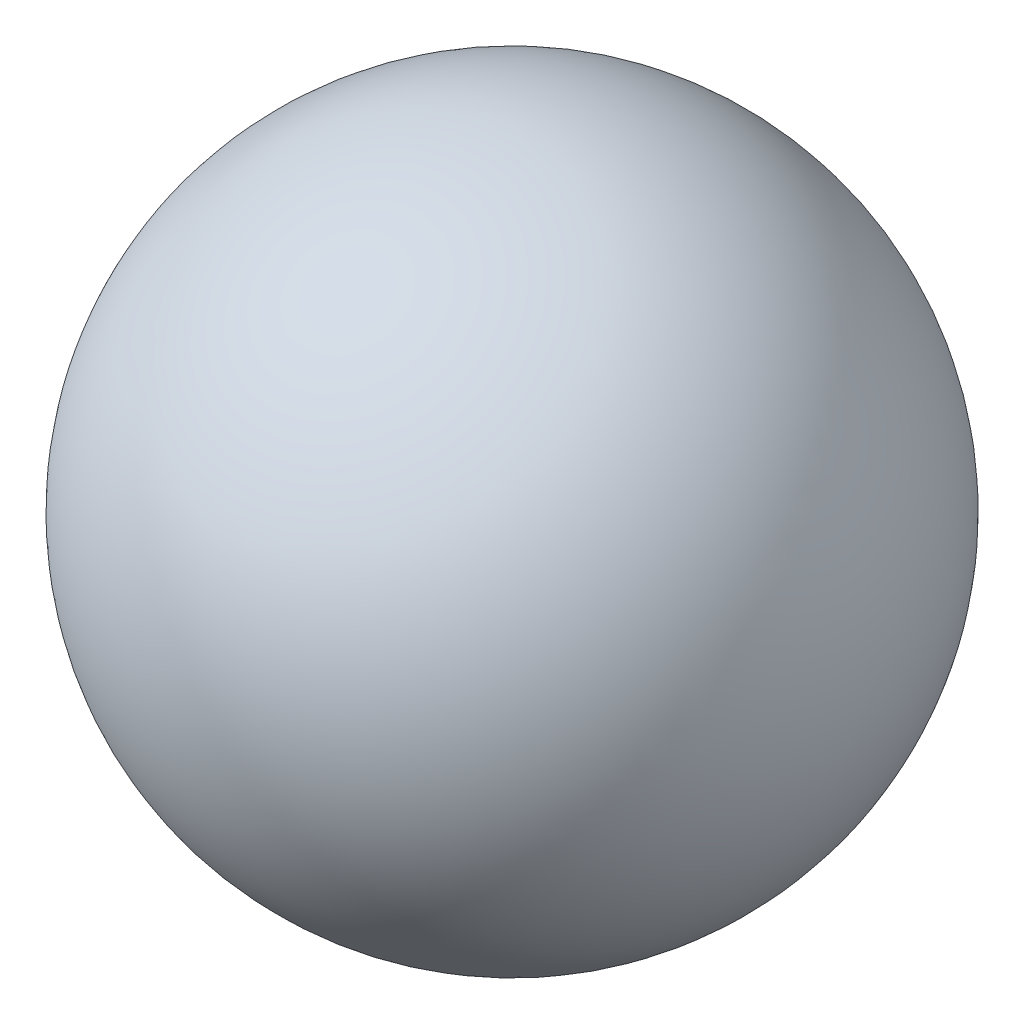
ISO-10303-21;
HEADER;
FILE_DESCRIPTION(('STEP AP214'),'2;1');
FILE_NAME('part.step','',(''),(''),'','','');
FILE_SCHEMA(('AUTOMOTIVE_DESIGN { 1 0 10303 214 1 1 1 1 }'));
ENDSEC;
DATA;
#1=APPLICATION_CONTEXT('core data for automotive mechanical design processes');
#2=APPLICATION_PROTOCOL_DEFINITION('international standard','automotive_design',2000,#1);
#3=PRODUCT_CONTEXT('',#1,'mechanical');
#4=PRODUCT('Part','Part','',(#3));
#5=PRODUCT_RELATED_PRODUCT_CATEGORY('part','',(#4));
#6=PRODUCT_DEFINITION_FORMATION('','',#4);
#7=PRODUCT_DEFINITION_CONTEXT('part definition',#1,'design');
#8=PRODUCT_DEFINITION('design','',#6,#7);
#9=PRODUCT_DEFINITION_SHAPE('','',#8);
#10=(LENGTH_UNIT() NAMED_UNIT(*) SI_UNIT(.MILLI.,.METRE.));
#11=(NAMED_UNIT(*) PLANE_ANGLE_UNIT() SI_UNIT($,.RADIAN.));
#12=(NAMED_UNIT(*) SI_UNIT($,.STERADIAN.) SOLID_ANGLE_UNIT());
#13=UNCERTAINTY_MEASURE_WITH_UNIT(LENGTH_MEASURE(1.E-05),#10,'distance_accuracy_value','');
#14=(GEOMETRIC_REPRESENTATION_CONTEXT(3) GLOBAL_UNCERTAINTY_ASSIGNED_CONTEXT((#13)) GLOBAL_UNIT_ASSIGNED_CONTEXT((#10,
#11,#12)) REPRESENTATION_CONTEXT('',''));
#15=CARTESIAN_POINT('',(0.,0.,0.));
#16=DIRECTION('',(0.,0.,1.));
#17=DIRECTION('',(1.,0.,0.));
#18=AXIS2_PLACEMENT_3D('',#15,#16,#17);
#19=CARTESIAN_POINT('',(4.2,0.,-3.95));
#20=DIRECTION('',(-1.,0.,0.));
#21=DIRECTION('',(0.,0.,1.));
#22=AXIS2_PLACEMENT_3D('',#19,#20,#21);
#23=SPHERICAL_SURFACE('',#22,2.55);
#24=CARTESIAN_POINT('',(1.65,0.,-3.95));
#25=VERTEX_POINT('',#24);
#26=VERTEX_LOOP('',#25);
#27=FACE_BOUND('',#26,.T.);
#28=ADVANCED_FACE('F32',(#27),#23,.T.);
#29=CLOSED_SHELL('',(#28));
#30=MANIFOLD_SOLID_BREP('B2',#29);
#31=ADVANCED_BREP_SHAPE_REPRESENTATION('',(#18,#30),#14);
#32=SHAPE_DEFINITION_REPRESENTATION(#9,#31);
ENDSEC;
END-ISO-10303-21;
